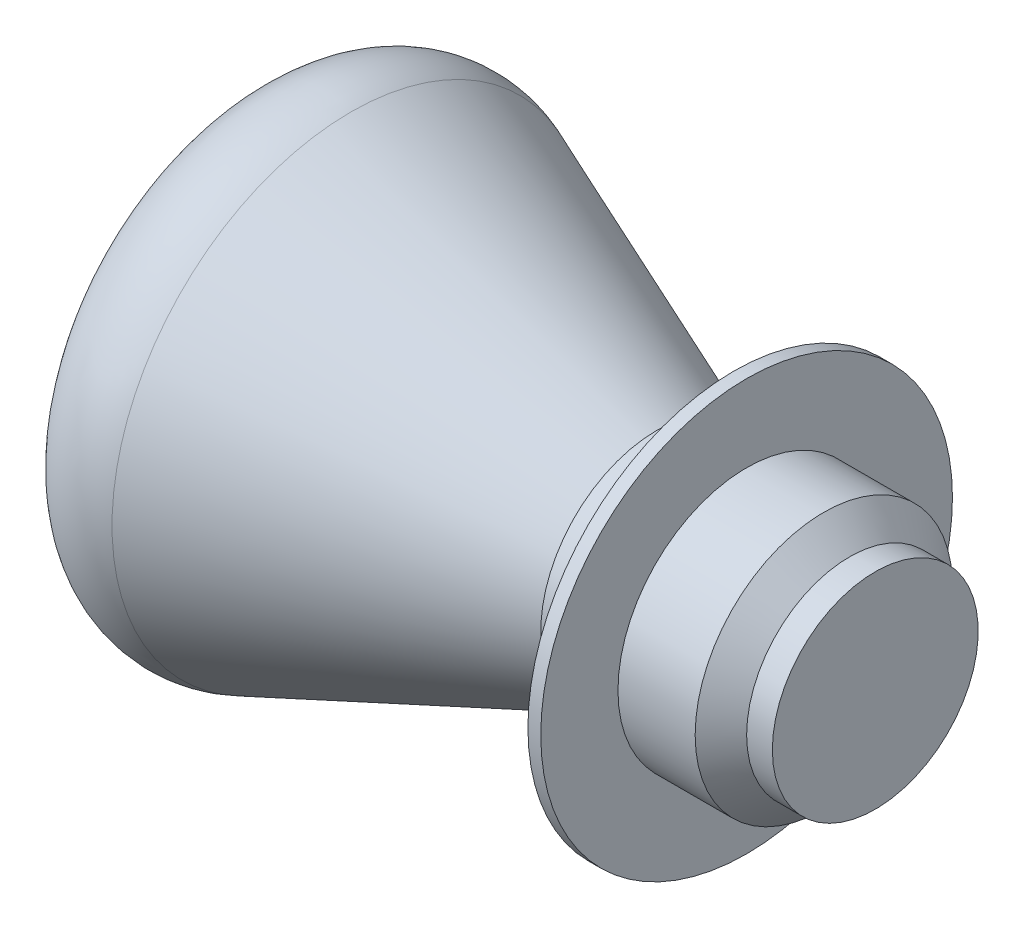
ISO-10303-21;
HEADER;
FILE_DESCRIPTION(('STEP AP214'),'2;1');
FILE_NAME('part.step','',(''),(''),'','','');
FILE_SCHEMA(('AUTOMOTIVE_DESIGN { 1 0 10303 214 1 1 1 1 }'));
ENDSEC;
DATA;
#1=APPLICATION_CONTEXT('core data for automotive mechanical design processes');
#2=APPLICATION_PROTOCOL_DEFINITION('international standard','automotive_design',2000,#1);
#3=PRODUCT_CONTEXT('',#1,'mechanical');
#4=PRODUCT('Part','Part','',(#3));
#5=PRODUCT_RELATED_PRODUCT_CATEGORY('part','',(#4));
#6=PRODUCT_DEFINITION_FORMATION('','',#4);
#7=PRODUCT_DEFINITION_CONTEXT('part definition',#1,'design');
#8=PRODUCT_DEFINITION('design','',#6,#7);
#9=PRODUCT_DEFINITION_SHAPE('','',#8);
#10=(LENGTH_UNIT() NAMED_UNIT(*) SI_UNIT(.MILLI.,.METRE.));
#11=(NAMED_UNIT(*) PLANE_ANGLE_UNIT() SI_UNIT($,.RADIAN.));
#12=(NAMED_UNIT(*) SI_UNIT($,.STERADIAN.) SOLID_ANGLE_UNIT());
#13=UNCERTAINTY_MEASURE_WITH_UNIT(LENGTH_MEASURE(1.E-05),#10,'distance_accuracy_value','');
#14=(GEOMETRIC_REPRESENTATION_CONTEXT(3) GLOBAL_UNCERTAINTY_ASSIGNED_CONTEXT((#13)) GLOBAL_UNIT_ASSIGNED_CONTEXT((#10,
#11,#12)) REPRESENTATION_CONTEXT('',''));
#15=CARTESIAN_POINT('',(0.,0.,0.));
#16=DIRECTION('',(0.,0.,1.));
#17=DIRECTION('',(1.,0.,0.));
#18=AXIS2_PLACEMENT_3D('',#15,#16,#17);
#19=CARTESIAN_POINT('',(0.,0.,0.));
#20=DIRECTION('',(1.,0.,0.));
#21=DIRECTION('',(0.,1.,0.));
#22=AXIS2_PLACEMENT_3D('',#19,#20,#21);
#23=PLANE('',#22);
#24=CARTESIAN_POINT('',(0.,0.,0.));
#25=DIRECTION('',(1.,0.,0.));
#26=DIRECTION('',(0.,1.,0.));
#27=AXIS2_PLACEMENT_3D('',#24,#25,#26);
#28=CIRCLE('',#27,4.5);
#29=CARTESIAN_POINT('',(0.,4.5,0.));
#30=VERTEX_POINT('',#29);
#31=EDGE_CURVE('E11',#30,#30,#28,.T.);
#32=ORIENTED_EDGE('',*,*,#31,.T.);
#33=EDGE_LOOP('',(#32));
#34=FACE_BOUND('',#33,.T.);
#35=ADVANCED_FACE('F45',(#34),#23,.T.);
#36=CARTESIAN_POINT('',(0.,0.,0.));
#37=DIRECTION('',(1.,0.,0.));
#38=DIRECTION('',(0.,1.,0.));
#39=AXIS2_PLACEMENT_3D('',#36,#37,#38);
#40=CYLINDRICAL_SURFACE('',#39,4.5);
#41=CARTESIAN_POINT('',(-3.,0.,0.));
#42=DIRECTION('',(1.,0.,0.));
#43=DIRECTION('',(0.,1.,0.));
#44=AXIS2_PLACEMENT_3D('',#41,#42,#43);
#45=CIRCLE('',#44,4.5);
#46=CARTESIAN_POINT('',(-3.,4.5,0.));
#47=VERTEX_POINT('',#46);
#48=EDGE_CURVE('E52',#47,#47,#45,.T.);
#49=ORIENTED_EDGE('',*,*,#48,.T.);
#50=EDGE_LOOP('',(#49));
#51=FACE_BOUND('',#50,.T.);
#52=ORIENTED_EDGE('',*,*,#31,.F.);
#53=EDGE_LOOP('',(#52));
#54=FACE_BOUND('',#53,.T.);
#55=ADVANCED_FACE('F81',(#51,#54),#40,.T.);
#56=CARTESIAN_POINT('',(-3.,0.,0.));
#57=DIRECTION('',(-1.,0.,0.));
#58=DIRECTION('',(0.,-1.,0.));
#59=AXIS2_PLACEMENT_3D('',#56,#57,#58);
#60=CONICAL_SURFACE('',#59,4.5,0.382760510475255);
#61=CARTESIAN_POINT('',(-14.8795520760162,0.,0.));
#62=DIRECTION('',(1.,0.,0.));
#63=DIRECTION('',(0.,1.,0.));
#64=AXIS2_PLACEMENT_3D('',#61,#62,#63);
#65=CIRCLE('',#64,9.28291150589458);
#66=CARTESIAN_POINT('',(-14.8795520760162,9.28291150589458,0.));
#67=VERTEX_POINT('',#66);
#68=EDGE_CURVE('E57',#67,#67,#65,.T.);
#69=ORIENTED_EDGE('',*,*,#68,.T.);
#70=EDGE_LOOP('',(#69));
#71=FACE_BOUND('',#70,.T.);
#72=ORIENTED_EDGE('',*,*,#48,.F.);
#73=EDGE_LOOP('',(#72));
#74=FACE_BOUND('',#73,.T.);
#75=ADVANCED_FACE('F78',(#71,#74),#60,.T.);
#76=CARTESIAN_POINT('',(-16.,0.,0.));
#77=DIRECTION('',(1.,0.,0.));
#78=DIRECTION('',(0.,1.,0.));
#79=AXIS2_PLACEMENT_3D('',#76,#77,#78);
#80=TOROIDAL_SURFACE('',#79,6.5,3.);
#81=CARTESIAN_POINT('',(-18.8971610617009,0.,0.));
#82=DIRECTION('',(1.,0.,0.));
#83=DIRECTION('',(0.,1.,0.));
#84=AXIS2_PLACEMENT_3D('',#81,#82,#83);
#85=CIRCLE('',#84,7.27875399361023);
#86=CARTESIAN_POINT('',(-18.8971610617009,7.27875399361022,0.));
#87=VERTEX_POINT('',#86);
#88=EDGE_CURVE('E62',#87,#87,#85,.T.);
#89=ORIENTED_EDGE('',*,*,#88,.T.);
#90=EDGE_LOOP('',(#89));
#91=FACE_BOUND('',#90,.T.);
#92=ORIENTED_EDGE('',*,*,#68,.F.);
#93=EDGE_LOOP('',(#92));
#94=FACE_BOUND('',#93,.T.);
#95=ADVANCED_FACE('F69',(#91,#94),#80,.T.);
#96=CARTESIAN_POINT('',(8.18163766166386,0.,0.));
#97=DIRECTION('',(1.,0.,0.));
#98=DIRECTION('',(0.,1.,0.));
#99=AXIS2_PLACEMENT_3D('',#96,#97,#98);
#100=SPHERICAL_SURFACE('',#99,28.04);
#101=ORIENTED_EDGE('',*,*,#88,.F.);
#102=EDGE_LOOP('',(#101));
#103=FACE_BOUND('',#102,.T.);
#104=ADVANCED_FACE('F72',(#103),#100,.T.);
#105=CLOSED_SHELL('',(#35,#55,#75,#95,#104));
#106=MANIFOLD_SOLID_BREP('B2',#105);
#107=CARTESIAN_POINT('',(0.,0.,0.));
#108=DIRECTION('',(-1.,0.,0.));
#109=DIRECTION('',(0.,0.,1.));
#110=AXIS2_PLACEMENT_3D('',#107,#108,#109);
#111=CYLINDRICAL_SURFACE('',#110,4.5);
#112=CARTESIAN_POINT('',(0.,0.,0.));
#113=DIRECTION('',(-1.,0.,0.));
#114=DIRECTION('',(0.,0.,1.));
#115=AXIS2_PLACEMENT_3D('',#112,#113,#114);
#116=CIRCLE('',#115,4.5);
#117=CARTESIAN_POINT('',(0.,0.,4.5));
#118=VERTEX_POINT('',#117);
#119=EDGE_CURVE('E154',#118,#118,#116,.T.);
#120=ORIENTED_EDGE('',*,*,#119,.F.);
#121=EDGE_LOOP('',(#120));
#122=FACE_BOUND('',#121,.T.);
#123=CARTESIAN_POINT('',(-2.,0.,0.));
#124=DIRECTION('',(-1.,0.,0.));
#125=DIRECTION('',(0.,0.,1.));
#126=AXIS2_PLACEMENT_3D('',#123,#124,#125);
#127=CIRCLE('',#126,4.5);
#128=CARTESIAN_POINT('',(-2.,0.,4.5));
#129=VERTEX_POINT('',#128);
#130=EDGE_CURVE('E44',#129,#129,#127,.T.);
#131=ORIENTED_EDGE('',*,*,#130,.T.);
#132=EDGE_LOOP('',(#131));
#133=FACE_BOUND('',#132,.T.);
#134=ADVANCED_FACE('F120',(#122,#133),#111,.F.);
#135=CARTESIAN_POINT('',(-2.,5.,0.));
#136=DIRECTION('',(1.,0.,0.));
#137=DIRECTION('',(0.,0.,-1.));
#138=AXIS2_PLACEMENT_3D('',#135,#136,#137);
#139=PLANE('',#138);
#140=ORIENTED_EDGE('',*,*,#130,.F.);
#141=EDGE_LOOP('',(#140));
#142=FACE_BOUND('',#141,.T.);
#143=CARTESIAN_POINT('',(-2.,0.,0.));
#144=DIRECTION('',(-1.,0.,0.));
#145=DIRECTION('',(0.,0.,1.));
#146=AXIS2_PLACEMENT_3D('',#143,#144,#145);
#147=CIRCLE('',#146,5.);
#148=CARTESIAN_POINT('',(-2.,0.,5.));
#149=VERTEX_POINT('',#148);
#150=EDGE_CURVE('E126',#149,#149,#147,.T.);
#151=ORIENTED_EDGE('',*,*,#150,.T.);
#152=EDGE_LOOP('',(#151));
#153=FACE_BOUND('',#152,.T.);
#154=ADVANCED_FACE('F161',(#142,#153),#139,.F.);
#155=CARTESIAN_POINT('',(0.,0.,0.));
#156=DIRECTION('',(-1.,0.,0.));
#157=DIRECTION('',(0.,0.,1.));
#158=AXIS2_PLACEMENT_3D('',#155,#156,#157);
#159=CYLINDRICAL_SURFACE('',#158,5.);
#160=ORIENTED_EDGE('',*,*,#150,.F.);
#161=EDGE_LOOP('',(#160));
#162=FACE_BOUND('',#161,.T.);
#163=CARTESIAN_POINT('',(0.,0.,0.));
#164=DIRECTION('',(-1.,0.,0.));
#165=DIRECTION('',(0.,0.,1.));
#166=AXIS2_PLACEMENT_3D('',#163,#164,#165);
#167=CIRCLE('',#166,5.);
#168=CARTESIAN_POINT('',(0.,0.,5.));
#169=VERTEX_POINT('',#168);
#170=EDGE_CURVE('E130',#169,#169,#167,.T.);
#171=ORIENTED_EDGE('',*,*,#170,.T.);
#172=EDGE_LOOP('',(#171));
#173=FACE_BOUND('',#172,.T.);
#174=ADVANCED_FACE('F165',(#162,#173),#159,.T.);
#175=CARTESIAN_POINT('',(0.,8.,0.));
#176=DIRECTION('',(1.,0.,0.));
#177=DIRECTION('',(0.,0.,-1.));
#178=AXIS2_PLACEMENT_3D('',#175,#176,#177);
#179=PLANE('',#178);
#180=ORIENTED_EDGE('',*,*,#170,.F.);
#181=EDGE_LOOP('',(#180));
#182=FACE_BOUND('',#181,.T.);
#183=CARTESIAN_POINT('',(0.,0.,0.));
#184=DIRECTION('',(-1.,0.,0.));
#185=DIRECTION('',(0.,0.,1.));
#186=AXIS2_PLACEMENT_3D('',#183,#184,#185);
#187=CIRCLE('',#186,8.);
#188=CARTESIAN_POINT('',(0.,0.,8.));
#189=VERTEX_POINT('',#188);
#190=EDGE_CURVE('E134',#189,#189,#187,.T.);
#191=ORIENTED_EDGE('',*,*,#190,.T.);
#192=EDGE_LOOP('',(#191));
#193=FACE_BOUND('',#192,.T.);
#194=ADVANCED_FACE('F170',(#182,#193),#179,.F.);
#195=CARTESIAN_POINT('',(0.,0.,0.));
#196=DIRECTION('',(-1.,0.,0.));
#197=DIRECTION('',(0.,0.,1.));
#198=AXIS2_PLACEMENT_3D('',#195,#196,#197);
#199=CYLINDRICAL_SURFACE('',#198,8.);
#200=ORIENTED_EDGE('',*,*,#190,.F.);
#201=EDGE_LOOP('',(#200));
#202=FACE_BOUND('',#201,.T.);
#203=CARTESIAN_POINT('',(0.499999999999999,0.,0.));
#204=DIRECTION('',(-1.,0.,0.));
#205=DIRECTION('',(0.,0.,1.));
#206=AXIS2_PLACEMENT_3D('',#203,#204,#205);
#207=CIRCLE('',#206,8.);
#208=CARTESIAN_POINT('',(0.499999999999999,0.,8.));
#209=VERTEX_POINT('',#208);
#210=EDGE_CURVE('E139',#209,#209,#207,.T.);
#211=ORIENTED_EDGE('',*,*,#210,.T.);
#212=EDGE_LOOP('',(#211));
#213=FACE_BOUND('',#212,.T.);
#214=ADVANCED_FACE('F176',(#202,#213),#199,.T.);
#215=CARTESIAN_POINT('',(0.499999999999999,5.,0.));
#216=DIRECTION('',(-1.,0.,0.));
#217=DIRECTION('',(0.,0.,1.));
#218=AXIS2_PLACEMENT_3D('',#215,#216,#217);
#219=PLANE('',#218);
#220=ORIENTED_EDGE('',*,*,#210,.F.);
#221=EDGE_LOOP('',(#220));
#222=FACE_BOUND('',#221,.T.);
#223=CARTESIAN_POINT('',(0.499999999999999,0.,0.));
#224=DIRECTION('',(-1.,0.,0.));
#225=DIRECTION('',(0.,0.,1.));
#226=AXIS2_PLACEMENT_3D('',#223,#224,#225);
#227=CIRCLE('',#226,5.);
#228=CARTESIAN_POINT('',(0.499999999999999,0.,5.));
#229=VERTEX_POINT('',#228);
#230=EDGE_CURVE('E142',#229,#229,#227,.T.);
#231=ORIENTED_EDGE('',*,*,#230,.T.);
#232=EDGE_LOOP('',(#231));
#233=FACE_BOUND('',#232,.T.);
#234=ADVANCED_FACE('F180',(#222,#233),#219,.F.);
#235=CARTESIAN_POINT('',(0.,0.,0.));
#236=DIRECTION('',(-1.,0.,0.));
#237=DIRECTION('',(0.,0.,1.));
#238=AXIS2_PLACEMENT_3D('',#235,#236,#237);
#239=CYLINDRICAL_SURFACE('',#238,5.);
#240=ORIENTED_EDGE('',*,*,#230,.F.);
#241=EDGE_LOOP('',(#240));
#242=FACE_BOUND('',#241,.T.);
#243=CARTESIAN_POINT('',(3.5,0.,0.));
#244=DIRECTION('',(-1.,0.,0.));
#245=DIRECTION('',(0.,0.,1.));
#246=AXIS2_PLACEMENT_3D('',#243,#244,#245);
#247=CIRCLE('',#246,5.);
#248=CARTESIAN_POINT('',(3.5,0.,5.));
#249=VERTEX_POINT('',#248);
#250=EDGE_CURVE('E145',#249,#249,#247,.T.);
#251=ORIENTED_EDGE('',*,*,#250,.T.);
#252=EDGE_LOOP('',(#251));
#253=FACE_BOUND('',#252,.T.);
#254=ADVANCED_FACE('F184',(#242,#253),#239,.T.);
#255=CARTESIAN_POINT('',(4.5,0.,0.));
#256=DIRECTION('',(-1.,0.,0.));
#257=DIRECTION('',(0.,0.,1.));
#258=AXIS2_PLACEMENT_3D('',#255,#256,#257);
#259=CONICAL_SURFACE('',#258,4.,0.785398163397448);
#260=ORIENTED_EDGE('',*,*,#250,.F.);
#261=EDGE_LOOP('',(#260));
#262=FACE_BOUND('',#261,.T.);
#263=CARTESIAN_POINT('',(4.5,0.,0.));
#264=DIRECTION('',(-1.,0.,0.));
#265=DIRECTION('',(0.,0.,1.));
#266=AXIS2_PLACEMENT_3D('',#263,#264,#265);
#267=CIRCLE('',#266,4.);
#268=CARTESIAN_POINT('',(4.5,0.,4.));
#269=VERTEX_POINT('',#268);
#270=EDGE_CURVE('E148',#269,#269,#267,.T.);
#271=ORIENTED_EDGE('',*,*,#270,.T.);
#272=EDGE_LOOP('',(#271));
#273=FACE_BOUND('',#272,.T.);
#274=ADVANCED_FACE('F188',(#262,#273),#259,.T.);
#275=CARTESIAN_POINT('',(0.,0.,0.));
#276=DIRECTION('',(-1.,0.,0.));
#277=DIRECTION('',(0.,0.,1.));
#278=AXIS2_PLACEMENT_3D('',#275,#276,#277);
#279=CYLINDRICAL_SURFACE('',#278,4.);
#280=ORIENTED_EDGE('',*,*,#270,.F.);
#281=EDGE_LOOP('',(#280));
#282=FACE_BOUND('',#281,.T.);
#283=CARTESIAN_POINT('',(5.5,0.,0.));
#284=DIRECTION('',(-1.,0.,0.));
#285=DIRECTION('',(0.,0.,1.));
#286=AXIS2_PLACEMENT_3D('',#283,#284,#285);
#287=CIRCLE('',#286,4.);
#288=CARTESIAN_POINT('',(5.5,0.,4.));
#289=VERTEX_POINT('',#288);
#290=EDGE_CURVE('E151',#289,#289,#287,.T.);
#291=ORIENTED_EDGE('',*,*,#290,.T.);
#292=EDGE_LOOP('',(#291));
#293=FACE_BOUND('',#292,.T.);
#294=ADVANCED_FACE('F192',(#282,#293),#279,.T.);
#295=CARTESIAN_POINT('',(5.5,0.,0.));
#296=DIRECTION('',(-1.,0.,0.));
#297=DIRECTION('',(0.,0.,1.));
#298=AXIS2_PLACEMENT_3D('',#295,#296,#297);
#299=PLANE('',#298);
#300=ORIENTED_EDGE('',*,*,#290,.F.);
#301=EDGE_LOOP('',(#300));
#302=FACE_BOUND('',#301,.T.);
#303=ADVANCED_FACE('F196',(#302),#299,.F.);
#304=CARTESIAN_POINT('',(0.,4.5,0.));
#305=DIRECTION('',(1.,0.,0.));
#306=DIRECTION('',(0.,0.,-1.));
#307=AXIS2_PLACEMENT_3D('',#304,#305,#306);
#308=PLANE('',#307);
#309=ORIENTED_EDGE('',*,*,#119,.T.);
#310=EDGE_LOOP('',(#309));
#311=FACE_BOUND('',#310,.T.);
#312=ADVANCED_FACE('F158',(#311),#308,.F.);
#313=CLOSED_SHELL('',(#134,#154,#174,#194,#214,#234,#254,#274,#294,#303,#312));
#314=MANIFOLD_SOLID_BREP('B6',#313);
#315=ADVANCED_BREP_SHAPE_REPRESENTATION('',(#18,#106,#314),#14);
#316=SHAPE_DEFINITION_REPRESENTATION(#9,#315);
ENDSEC;
END-ISO-10303-21;
